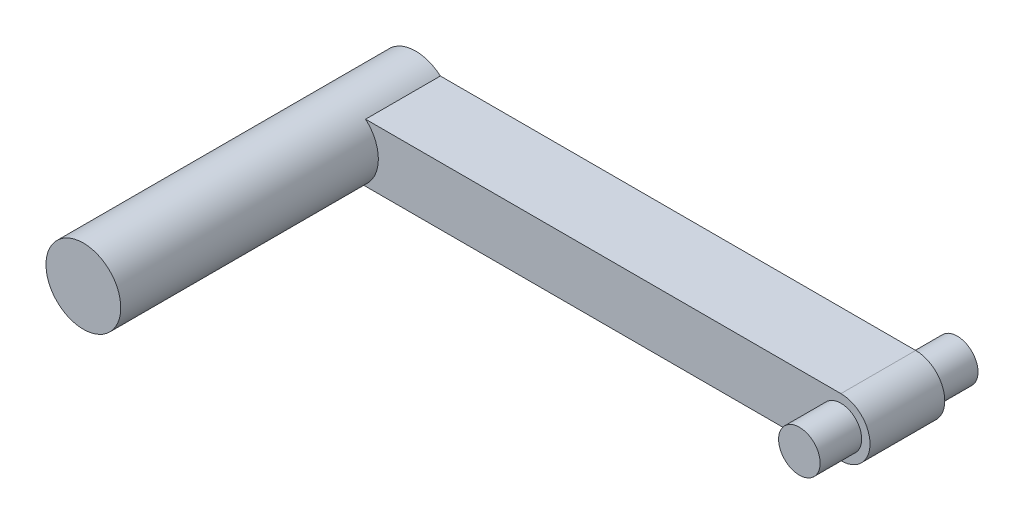
ISO-10303-21;
HEADER;
FILE_DESCRIPTION(('STEP AP214'),'2;1');
FILE_NAME('part.step','',(''),(''),'','','');
FILE_SCHEMA(('AUTOMOTIVE_DESIGN { 1 0 10303 214 1 1 1 1 }'));
ENDSEC;
DATA;
#1=APPLICATION_CONTEXT('core data for automotive mechanical design processes');
#2=APPLICATION_PROTOCOL_DEFINITION('international standard','automotive_design',2000,#1);
#3=PRODUCT_CONTEXT('',#1,'mechanical');
#4=PRODUCT('Part','Part','',(#3));
#5=PRODUCT_RELATED_PRODUCT_CATEGORY('part','',(#4));
#6=PRODUCT_DEFINITION_FORMATION('','',#4);
#7=PRODUCT_DEFINITION_CONTEXT('part definition',#1,'design');
#8=PRODUCT_DEFINITION('design','',#6,#7);
#9=PRODUCT_DEFINITION_SHAPE('','',#8);
#10=(LENGTH_UNIT() NAMED_UNIT(*) SI_UNIT(.MILLI.,.METRE.));
#11=(NAMED_UNIT(*) PLANE_ANGLE_UNIT() SI_UNIT($,.RADIAN.));
#12=(NAMED_UNIT(*) SI_UNIT($,.STERADIAN.) SOLID_ANGLE_UNIT());
#13=UNCERTAINTY_MEASURE_WITH_UNIT(LENGTH_MEASURE(1.E-05),#10,'distance_accuracy_value','');
#14=(GEOMETRIC_REPRESENTATION_CONTEXT(3) GLOBAL_UNCERTAINTY_ASSIGNED_CONTEXT((#13)) GLOBAL_UNIT_ASSIGNED_CONTEXT((#10,
#11,#12)) REPRESENTATION_CONTEXT('',''));
#15=CARTESIAN_POINT('',(0.,0.,0.));
#16=DIRECTION('',(0.,0.,1.));
#17=DIRECTION('',(1.,0.,0.));
#18=AXIS2_PLACEMENT_3D('',#15,#16,#17);
#19=CARTESIAN_POINT('',(29.,-3.5,-4.5));
#20=DIRECTION('',(0.,0.,1.));
#21=DIRECTION('',(0.,-1.,0.));
#22=AXIS2_PLACEMENT_3D('',#19,#20,#21);
#23=CYLINDRICAL_SURFACE('',#22,3.5);
#24=DIRECTION('',(0.,0.,-1.));
#25=VECTOR('',#24,1.);
#26=CARTESIAN_POINT('',(29.,-7.,-4.5));
#27=LINE('',#26,#25);
#28=CARTESIAN_POINT('',(29.,-7.,-4.5));
#29=VERTEX_POINT('',#28);
#30=CARTESIAN_POINT('',(29.,-7.,4.5));
#31=VERTEX_POINT('',#30);
#32=EDGE_CURVE('E11',#29,#31,#27,.F.);
#33=ORIENTED_EDGE('',*,*,#32,.F.);
#34=CARTESIAN_POINT('',(29.,-3.5,-4.5));
#35=DIRECTION('',(0.,0.,1.));
#36=DIRECTION('',(0.,-1.,0.));
#37=AXIS2_PLACEMENT_3D('',#34,#35,#36);
#38=CIRCLE('',#37,3.5);
#39=CARTESIAN_POINT('',(29.,0.,-4.5));
#40=VERTEX_POINT('',#39);
#41=EDGE_CURVE('E25',#40,#29,#38,.F.);
#42=ORIENTED_EDGE('',*,*,#41,.F.);
#43=DIRECTION('',(0.,0.,1.));
#44=VECTOR('',#43,1.);
#45=CARTESIAN_POINT('',(29.,0.,0.));
#46=LINE('',#45,#44);
#47=CARTESIAN_POINT('',(29.,0.,4.5));
#48=VERTEX_POINT('',#47);
#49=EDGE_CURVE('E83',#48,#40,#46,.F.);
#50=ORIENTED_EDGE('',*,*,#49,.F.);
#51=CARTESIAN_POINT('',(29.,-3.5,4.5));
#52=DIRECTION('',(0.,0.,-1.));
#53=DIRECTION('',(0.,1.,0.));
#54=AXIS2_PLACEMENT_3D('',#51,#52,#53);
#55=CIRCLE('',#54,3.5);
#56=EDGE_CURVE('E120',#31,#48,#55,.F.);
#57=ORIENTED_EDGE('',*,*,#56,.F.);
#58=EDGE_LOOP('',(#33,#42,#50,#57));
#59=FACE_BOUND('',#58,.T.);
#60=ADVANCED_FACE('F17',(#59),#23,.T.);
#61=CARTESIAN_POINT('',(-32.5,-7.,4.5));
#62=DIRECTION('',(0.,0.,-1.));
#63=DIRECTION('',(0.,1.,0.));
#64=AXIS2_PLACEMENT_3D('',#61,#62,#63);
#65=PLANE('',#64);
#66=CARTESIAN_POINT('',(29.,-3.5,4.5));
#67=DIRECTION('',(0.,0.,-1.));
#68=DIRECTION('',(0.,1.,0.));
#69=AXIS2_PLACEMENT_3D('',#66,#67,#68);
#70=CIRCLE('',#69,2.5);
#71=CARTESIAN_POINT('',(29.,-1.,4.5));
#72=VERTEX_POINT('',#71);
#73=EDGE_CURVE('E116',#72,#72,#70,.T.);
#74=ORIENTED_EDGE('',*,*,#73,.T.);
#75=EDGE_LOOP('',(#74));
#76=FACE_BOUND('',#75,.T.);
#77=DIRECTION('',(-1.,0.,0.));
#78=VECTOR('',#77,1.);
#79=CARTESIAN_POINT('',(-32.5,0.,4.5));
#80=LINE('',#79,#78);
#81=CARTESIAN_POINT('',(-28.2035604160807,0.,4.5));
#82=VERTEX_POINT('',#81);
#83=EDGE_CURVE('E113',#48,#82,#80,.T.);
#84=ORIENTED_EDGE('',*,*,#83,.T.);
#85=CARTESIAN_POINT('',(-31.1680124414942,-3.38556113355312,4.5));
#86=DIRECTION('',(0.,0.,-1.));
#87=DIRECTION('',(0.,1.,0.));
#88=AXIS2_PLACEMENT_3D('',#85,#86,#87);
#89=CIRCLE('',#88,4.50000000000041);
#90=CARTESIAN_POINT('',(-28.4873722790103,-7.,4.5));
#91=VERTEX_POINT('',#90);
#92=EDGE_CURVE('E88',#82,#91,#89,.T.);
#93=ORIENTED_EDGE('',*,*,#92,.T.);
#94=DIRECTION('',(-1.,0.,0.));
#95=VECTOR('',#94,1.);
#96=CARTESIAN_POINT('',(-32.5,-7.,4.5));
#97=LINE('',#96,#95);
#98=EDGE_CURVE('E107',#31,#91,#97,.T.);
#99=ORIENTED_EDGE('',*,*,#98,.F.);
#100=ORIENTED_EDGE('',*,*,#56,.T.);
#101=EDGE_LOOP('',(#84,#93,#99,#100));
#102=FACE_BOUND('',#101,.T.);
#103=ADVANCED_FACE('F131',(#76,#102),#65,.F.);
#104=CARTESIAN_POINT('',(-32.5,-7.,-4.5));
#105=DIRECTION('',(0.,0.,1.));
#106=DIRECTION('',(0.,-1.,0.));
#107=AXIS2_PLACEMENT_3D('',#104,#105,#106);
#108=PLANE('',#107);
#109=CARTESIAN_POINT('',(29.,-3.5,-4.5));
#110=DIRECTION('',(0.,0.,1.));
#111=DIRECTION('',(0.,-1.,0.));
#112=AXIS2_PLACEMENT_3D('',#109,#110,#111);
#113=CIRCLE('',#112,2.5);
#114=CARTESIAN_POINT('',(29.,-6.,-4.5));
#115=VERTEX_POINT('',#114);
#116=EDGE_CURVE('E103',#115,#115,#113,.T.);
#117=ORIENTED_EDGE('',*,*,#116,.T.);
#118=EDGE_LOOP('',(#117));
#119=FACE_BOUND('',#118,.T.);
#120=DIRECTION('',(1.,0.,0.));
#121=VECTOR('',#120,1.);
#122=CARTESIAN_POINT('',(-32.5,-7.,-4.5));
#123=LINE('',#122,#121);
#124=CARTESIAN_POINT('',(-28.4873722790103,-7.,-4.5));
#125=VERTEX_POINT('',#124);
#126=EDGE_CURVE('E70',#125,#29,#123,.T.);
#127=ORIENTED_EDGE('',*,*,#126,.F.);
#128=CARTESIAN_POINT('',(-31.1680124414942,-3.38556113355312,-4.5));
#129=DIRECTION('',(0.,0.,-1.));
#130=DIRECTION('',(0.,1.,0.));
#131=AXIS2_PLACEMENT_3D('',#128,#129,#130);
#132=CIRCLE('',#131,4.50000000000041);
#133=CARTESIAN_POINT('',(-28.2035604160807,0.,-4.5));
#134=VERTEX_POINT('',#133);
#135=EDGE_CURVE('E64',#125,#134,#132,.T.);
#136=ORIENTED_EDGE('',*,*,#135,.T.);
#137=DIRECTION('',(1.,0.,0.));
#138=VECTOR('',#137,1.);
#139=CARTESIAN_POINT('',(-32.5,0.,-4.5));
#140=LINE('',#139,#138);
#141=EDGE_CURVE('E67',#134,#40,#140,.T.);
#142=ORIENTED_EDGE('',*,*,#141,.T.);
#143=ORIENTED_EDGE('',*,*,#41,.T.);
#144=EDGE_LOOP('',(#127,#136,#142,#143));
#145=FACE_BOUND('',#144,.T.);
#146=ADVANCED_FACE('F66',(#119,#145),#108,.F.);
#147=CARTESIAN_POINT('',(0.,-7.,0.));
#148=DIRECTION('',(0.,-1.,0.));
#149=DIRECTION('',(1.,0.,0.));
#150=AXIS2_PLACEMENT_3D('',#147,#148,#149);
#151=PLANE('',#150);
#152=DIRECTION('',(0.,0.,-1.));
#153=VECTOR('',#152,1.);
#154=CARTESIAN_POINT('',(-28.4873722790103,-7.,35.5));
#155=LINE('',#154,#153);
#156=EDGE_CURVE('E85',#125,#91,#155,.F.);
#157=ORIENTED_EDGE('',*,*,#156,.F.);
#158=ORIENTED_EDGE('',*,*,#126,.T.);
#159=ORIENTED_EDGE('',*,*,#32,.T.);
#160=ORIENTED_EDGE('',*,*,#98,.T.);
#161=EDGE_LOOP('',(#157,#158,#159,#160));
#162=FACE_BOUND('',#161,.T.);
#163=ADVANCED_FACE('F128',(#162),#151,.T.);
#164=CARTESIAN_POINT('',(0.,0.,0.));
#165=DIRECTION('',(0.,-1.,0.));
#166=DIRECTION('',(1.,0.,0.));
#167=AXIS2_PLACEMENT_3D('',#164,#165,#166);
#168=PLANE('',#167);
#169=ORIENTED_EDGE('',*,*,#141,.F.);
#170=DIRECTION('',(0.,0.,-1.));
#171=VECTOR('',#170,1.);
#172=CARTESIAN_POINT('',(-28.2035604160807,0.,35.5));
#173=LINE('',#172,#171);
#174=EDGE_CURVE('E81',#134,#82,#173,.F.);
#175=ORIENTED_EDGE('',*,*,#174,.T.);
#176=ORIENTED_EDGE('',*,*,#83,.F.);
#177=ORIENTED_EDGE('',*,*,#49,.T.);
#178=EDGE_LOOP('',(#169,#175,#176,#177));
#179=FACE_BOUND('',#178,.T.);
#180=ADVANCED_FACE('F79',(#179),#168,.F.);
#181=CARTESIAN_POINT('',(29.,-3.5,-9.5));
#182=DIRECTION('',(0.,0.,1.));
#183=DIRECTION('',(0.,-1.,0.));
#184=AXIS2_PLACEMENT_3D('',#181,#182,#183);
#185=PLANE('',#184);
#186=CARTESIAN_POINT('',(29.,-3.5,-9.5));
#187=DIRECTION('',(0.,0.,1.));
#188=DIRECTION('',(0.,-1.,0.));
#189=AXIS2_PLACEMENT_3D('',#186,#187,#188);
#190=CIRCLE('',#189,2.5);
#191=CARTESIAN_POINT('',(29.,-6.,-9.5));
#192=VERTEX_POINT('',#191);
#193=EDGE_CURVE('E90',#192,#192,#190,.T.);
#194=ORIENTED_EDGE('',*,*,#193,.F.);
#195=EDGE_LOOP('',(#194));
#196=FACE_BOUND('',#195,.T.);
#197=ADVANCED_FACE('F148',(#196),#185,.F.);
#198=CARTESIAN_POINT('',(29.,-3.5,-9.5));
#199=DIRECTION('',(0.,0.,1.));
#200=DIRECTION('',(0.,-1.,0.));
#201=AXIS2_PLACEMENT_3D('',#198,#199,#200);
#202=CYLINDRICAL_SURFACE('',#201,2.5);
#203=ORIENTED_EDGE('',*,*,#193,.T.);
#204=EDGE_LOOP('',(#203));
#205=FACE_BOUND('',#204,.T.);
#206=ORIENTED_EDGE('',*,*,#116,.F.);
#207=EDGE_LOOP('',(#206));
#208=FACE_BOUND('',#207,.T.);
#209=ADVANCED_FACE('F151',(#205,#208),#202,.T.);
#210=CARTESIAN_POINT('',(29.,-3.5,-9.5));
#211=DIRECTION('',(0.,0.,1.));
#212=DIRECTION('',(0.,-1.,0.));
#213=AXIS2_PLACEMENT_3D('',#210,#211,#212);
#214=CYLINDRICAL_SURFACE('',#213,2.5);
#215=CARTESIAN_POINT('',(29.,-3.5,9.5));
#216=DIRECTION('',(0.,0.,1.));
#217=DIRECTION('',(0.,-1.,0.));
#218=AXIS2_PLACEMENT_3D('',#215,#216,#217);
#219=CIRCLE('',#218,2.5);
#220=CARTESIAN_POINT('',(29.,-6.,9.5));
#221=VERTEX_POINT('',#220);
#222=EDGE_CURVE('E97',#221,#221,#219,.T.);
#223=ORIENTED_EDGE('',*,*,#222,.F.);
#224=EDGE_LOOP('',(#223));
#225=FACE_BOUND('',#224,.T.);
#226=ORIENTED_EDGE('',*,*,#73,.F.);
#227=EDGE_LOOP('',(#226));
#228=FACE_BOUND('',#227,.T.);
#229=ADVANCED_FACE('F155',(#225,#228),#214,.T.);
#230=CARTESIAN_POINT('',(29.,-3.5,9.5));
#231=DIRECTION('',(0.,0.,1.));
#232=DIRECTION('',(0.,-1.,0.));
#233=AXIS2_PLACEMENT_3D('',#230,#231,#232);
#234=PLANE('',#233);
#235=ORIENTED_EDGE('',*,*,#222,.T.);
#236=EDGE_LOOP('',(#235));
#237=FACE_BOUND('',#236,.T.);
#238=ADVANCED_FACE('F159',(#237),#234,.T.);
#239=CARTESIAN_POINT('',(-31.1680124414942,-3.38556113355312,35.5));
#240=DIRECTION('',(0.,0.,-1.));
#241=DIRECTION('',(0.,1.,0.));
#242=AXIS2_PLACEMENT_3D('',#239,#240,#241);
#243=CYLINDRICAL_SURFACE('',#242,4.50000000000041);
#244=CARTESIAN_POINT('',(-31.1680124414942,-3.38556113355312,35.5));
#245=DIRECTION('',(0.,0.,-1.));
#246=DIRECTION('',(0.,1.,0.));
#247=AXIS2_PLACEMENT_3D('',#244,#245,#246);
#248=CIRCLE('',#247,4.50000000000041);
#249=CARTESIAN_POINT('',(-31.1680124414942,1.11443886644729,35.5));
#250=VERTEX_POINT('',#249);
#251=EDGE_CURVE('E174',#250,#250,#248,.T.);
#252=ORIENTED_EDGE('',*,*,#251,.T.);
#253=EDGE_LOOP('',(#252));
#254=FACE_BOUND('',#253,.T.);
#255=ORIENTED_EDGE('',*,*,#135,.F.);
#256=ORIENTED_EDGE('',*,*,#156,.T.);
#257=ORIENTED_EDGE('',*,*,#92,.F.);
#258=ORIENTED_EDGE('',*,*,#174,.F.);
#259=EDGE_LOOP('',(#255,#256,#257,#258));
#260=FACE_BOUND('',#259,.T.);
#261=ADVANCED_FACE('F87',(#254,#260),#243,.T.);
#262=CARTESIAN_POINT('',(-31.1680124414942,-3.38556113355312,35.5));
#263=DIRECTION('',(0.,0.,-1.));
#264=DIRECTION('',(0.,1.,0.));
#265=AXIS2_PLACEMENT_3D('',#262,#263,#264);
#266=PLANE('',#265);
#267=ORIENTED_EDGE('',*,*,#251,.F.);
#268=EDGE_LOOP('',(#267));
#269=FACE_BOUND('',#268,.T.);
#270=ADVANCED_FACE('F166',(#269),#266,.F.);
#271=CLOSED_SHELL('',(#60,#103,#146,#163,#180,#197,#209,#229,#238,#261,#270));
#272=MANIFOLD_SOLID_BREP('B1',#271);
#273=ADVANCED_BREP_SHAPE_REPRESENTATION('',(#18,#272),#14);
#274=SHAPE_DEFINITION_REPRESENTATION(#9,#273);
ENDSEC;
END-ISO-10303-21;
